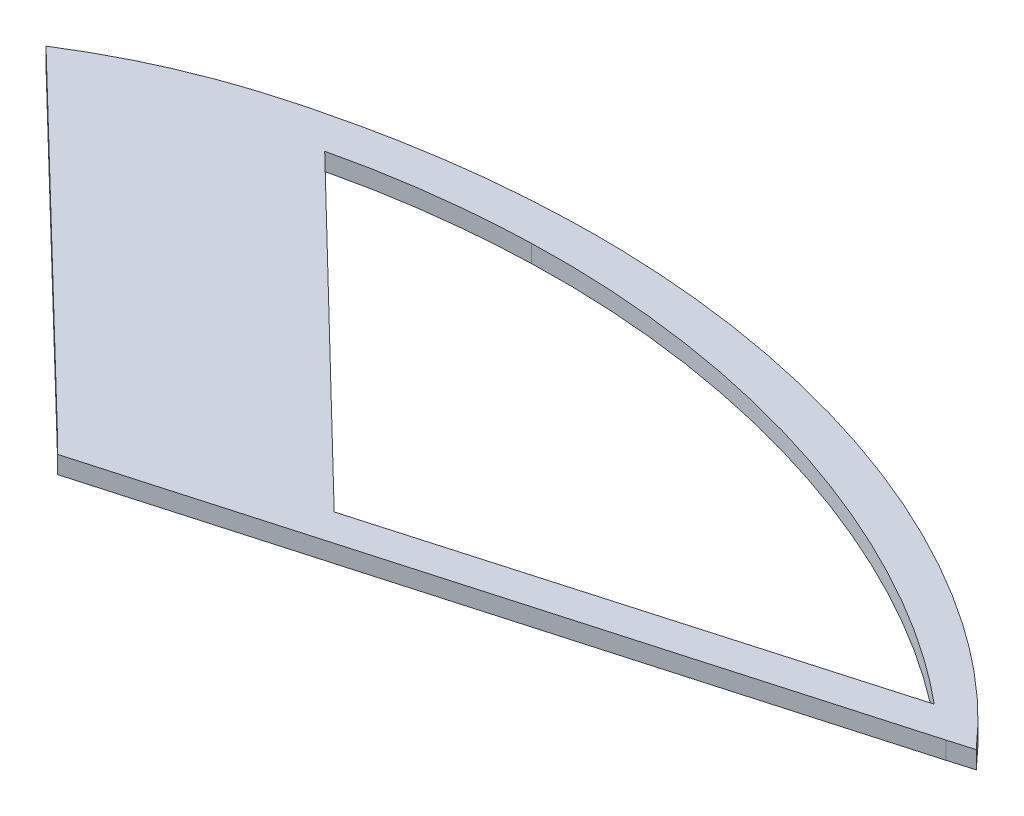
ISO-10303-21;
HEADER;
FILE_DESCRIPTION(('STEP AP214'),'2;1');
FILE_NAME('part.step','',(''),(''),'','','');
FILE_SCHEMA(('AUTOMOTIVE_DESIGN { 1 0 10303 214 1 1 1 1 }'));
ENDSEC;
DATA;
#1=APPLICATION_CONTEXT('core data for automotive mechanical design processes');
#2=APPLICATION_PROTOCOL_DEFINITION('international standard','automotive_design',2000,#1);
#3=PRODUCT_CONTEXT('',#1,'mechanical');
#4=PRODUCT('Part','Part','',(#3));
#5=PRODUCT_RELATED_PRODUCT_CATEGORY('part','',(#4));
#6=PRODUCT_DEFINITION_FORMATION('','',#4);
#7=PRODUCT_DEFINITION_CONTEXT('part definition',#1,'design');
#8=PRODUCT_DEFINITION('design','',#6,#7);
#9=PRODUCT_DEFINITION_SHAPE('','',#8);
#10=(LENGTH_UNIT() NAMED_UNIT(*) SI_UNIT(.MILLI.,.METRE.));
#11=(NAMED_UNIT(*) PLANE_ANGLE_UNIT() SI_UNIT($,.RADIAN.));
#12=(NAMED_UNIT(*) SI_UNIT($,.STERADIAN.) SOLID_ANGLE_UNIT());
#13=UNCERTAINTY_MEASURE_WITH_UNIT(LENGTH_MEASURE(1.E-05),#10,'distance_accuracy_value','');
#14=(GEOMETRIC_REPRESENTATION_CONTEXT(3) GLOBAL_UNCERTAINTY_ASSIGNED_CONTEXT((#13)) GLOBAL_UNIT_ASSIGNED_CONTEXT((#10,
#11,#12)) REPRESENTATION_CONTEXT('',''));
#15=CARTESIAN_POINT('',(0.,0.,0.));
#16=DIRECTION('',(0.,0.,1.));
#17=DIRECTION('',(1.,0.,0.));
#18=AXIS2_PLACEMENT_3D('',#15,#16,#17);
#19=CARTESIAN_POINT('',(-9.871927348,12.954,-83.317512981));
#20=DIRECTION('',(0.,1.,0.));
#21=DIRECTION('',(0.,0.,1.));
#22=AXIS2_PLACEMENT_3D('',#19,#20,#21);
#23=PLANE('',#22);
#24=CARTESIAN_POINT('',(-6.44549620304291,12.954,-82.3392040324643));
#25=CARTESIAN_POINT('',(-6.34659800777921,12.954,-82.3626682368923));
#26=CARTESIAN_POINT('',(-6.24741169684658,12.954,-82.3849041496113));
#27=CARTESIAN_POINT('',(-6.04852286511272,12.954,-82.4269296454256));
#28=CARTESIAN_POINT('',(-5.94882034827822,12.954,-82.4467192472902));
#29=CARTESIAN_POINT('',(-5.68039666446252,12.954,-82.4966044420451));
#30=CARTESIAN_POINT('',(-5.51125375014717,12.954,-82.5244556849329));
#31=CARTESIAN_POINT('',(-5.17197242544379,12.954,-82.5733828893412));
#32=CARTESIAN_POINT('',(-5.00183387155782,12.954,-82.5944578484471));
#33=CARTESIAN_POINT('',(-4.65984033571563,12.954,-82.6301726004586));
#34=CARTESIAN_POINT('',(-4.48798120929984,12.954,-82.6447724503704));
#35=CARTESIAN_POINT('',(-4.1438846534634,12.954,-82.6676645563772));
#36=CARTESIAN_POINT('',(-3.97164732981602,12.954,-82.6759583946487));
#37=CARTESIAN_POINT('',(-3.7993321421016,12.954,-82.6812606729969));
#38=B_SPLINE_CURVE_WITH_KNOTS('',3,(#24,#25,#26,#27,#28,#29,#30,#31,#32,#33,#34,#35,#36,#37),
.UNSPECIFIED.,.F.,.F.,(4,2,2,2,2,2,4),(0.,0.304916879839936,0.609831420046243,1.12394181147945,
1.63812822024012,2.15544381137501,2.67262956529792),.UNSPECIFIED.);
#39=CARTESIAN_POINT('',(-6.44549620402146,12.954,-82.3392040322321));
#40=VERTEX_POINT('',#39);
#41=CARTESIAN_POINT('',(-3.79933214210171,12.954,-82.6812606729969));
#42=VERTEX_POINT('',#41);
#43=EDGE_CURVE('E87',#40,#42,#38,.T.);
#44=ORIENTED_EDGE('',*,*,#43,.T.);
#45=CARTESIAN_POINT('',(-3.79933214210182,12.954,-82.6812606729968));
#46=CARTESIAN_POINT('',(-3.59617572272677,12.954,-82.6876119718258));
#47=CARTESIAN_POINT('',(-3.39284743166303,12.954,-82.6890689719829));
#48=CARTESIAN_POINT('',(-2.78115641969021,12.954,-82.6790622284626));
#49=CARTESIAN_POINT('',(-2.37296203900884,12.954,-82.65307475667));
#50=CARTESIAN_POINT('',(-1.56039169667328,12.954,-82.5642687335934));
#51=CARTESIAN_POINT('',(-1.15601895811979,12.954,-82.5014214997044));
#52=CARTESIAN_POINT('',(-0.376428822526477,12.954,-82.3448357418596));
#53=CARTESIAN_POINT('',(-0.000832718618430368,12.954,-82.2529903114214));
#54=CARTESIAN_POINT('',(0.555712122099293,12.954,-82.092278675641));
#55=CARTESIAN_POINT('',(0.740050038313632,12.954,-82.0348977158226));
#56=CARTESIAN_POINT('',(1.10623976627383,12.954,-81.91251159206));
#57=CARTESIAN_POINT('',(1.28809095956808,12.954,-81.8475045686687));
#58=CARTESIAN_POINT('',(1.67353557019621,12.954,-81.7005072194933));
#59=CARTESIAN_POINT('',(1.87670772228265,12.954,-81.6174099214902));
#60=CARTESIAN_POINT('',(2.27877675627463,12.954,-81.4413634426536));
#61=CARTESIAN_POINT('',(2.47767302030433,12.954,-81.3484128493534));
#62=CARTESIAN_POINT('',(2.87046158022985,12.954,-81.1525709207472));
#63=CARTESIAN_POINT('',(3.06435504557182,12.954,-81.0496819357944));
#64=CARTESIAN_POINT('',(3.44733541386283,12.954,-80.8332074195657));
#65=CARTESIAN_POINT('',(3.63639421674016,12.954,-80.7195721009166));
#66=CARTESIAN_POINT('',(4.00779689766742,12.954,-80.4816757996074));
#67=CARTESIAN_POINT('',(4.1901394727901,12.954,-80.3574127705757));
#68=CARTESIAN_POINT('',(4.4577304457105,12.954,-80.1626783989408));
#69=CARTESIAN_POINT('',(4.5459970764099,12.954,-80.0963300142813));
#70=CARTESIAN_POINT('',(4.72033458161968,12.954,-79.9607900047128));
#71=CARTESIAN_POINT('',(4.80640520461762,12.954,-79.891598056474));
#72=CARTESIAN_POINT('',(4.89127951213176,12.954,-79.8209494748903));
#73=B_SPLINE_CURVE_WITH_KNOTS('',3,(#45,#46,#47,#48,#49,#50,#51,#52,#53,#54,#55,#56,#57,#58,#59,
#60,#61,#62,#63,#64,#65,#66,#67,#68,#69,#70,#71,#72),.UNSPECIFIED.,.F.,.F.,(4,2,2,2,2,2,2,2,2,2,
2,2,2,4),(0.,0.609774049446489,1.83493903388301,3.06105865376051,4.21961329184825,
4.79866354834578,5.37785528807172,6.03612292805049,6.69448505841803,7.35269187064562,
8.01411334448607,8.67566246336649,9.00687834191437,9.33813198641507),.UNSPECIFIED.);
#74=CARTESIAN_POINT('',(4.891279512,12.954,-79.820949475));
#75=VERTEX_POINT('',#74);
#76=EDGE_CURVE('E90',#42,#75,#73,.T.);
#77=ORIENTED_EDGE('',*,*,#76,.T.);
#78=DIRECTION('',(-0.96139006085871,0.,0.275189300086477));
#79=VECTOR('',#78,1.);
#80=CARTESIAN_POINT('',(1.516581107,12.954,-78.8549722615));
#81=LINE('',#80,#79);
#82=CARTESIAN_POINT('',(-1.858117298,12.954,-77.888995048));
#83=VERTEX_POINT('',#82);
#84=EDGE_CURVE('E113',#75,#83,#81,.T.);
#85=ORIENTED_EDGE('',*,*,#84,.T.);
#86=DIRECTION('',(-0.717756378085368,0.,-0.696294321187366));
#87=VECTOR('',#86,1.);
#88=CARTESIAN_POINT('',(-4.1518067515,12.954,-80.11409954));
#89=LINE('',#88,#87);
#90=EDGE_CURVE('E92',#83,#40,#89,.T.);
#91=ORIENTED_EDGE('',*,*,#90,.T.);
#92=EDGE_LOOP('',(#44,#77,#85,#91));
#93=FACE_BOUND('',#92,.T.);
#94=DIRECTION('',(0.96061640835191,0.,-0.277877879661329));
#95=VECTOR('',#94,1.);
#96=CARTESIAN_POINT('',(5.596084036,12.954,-79.5065293905));
#97=LINE('',#96,#95);
#98=CARTESIAN_POINT('',(5.428352324718,12.954,-79.4570364438506));
#99=VERTEX_POINT('',#98);
#100=CARTESIAN_POINT('',(5.76465255782301,12.954,-79.5552912722026));
#101=VERTEX_POINT('',#100);
#102=EDGE_CURVE('E120',#99,#101,#97,.T.);
#103=ORIENTED_EDGE('',*,*,#102,.T.);
#104=CARTESIAN_POINT('',(5.76465255764603,12.954,-79.5552912724051));
#105=CARTESIAN_POINT('',(5.69771351624012,12.954,-79.6319005370332));
#106=CARTESIAN_POINT('',(5.62928088525685,12.954,-79.70716270109));
#107=CARTESIAN_POINT('',(5.48964442494502,12.954,-79.8550308917549));
#108=CARTESIAN_POINT('',(5.41844140963843,12.954,-79.9276376866061));
#109=CARTESIAN_POINT('',(5.05352737794468,12.954,-80.2866114680925));
#110=CARTESIAN_POINT('',(4.7400108784828,12.954,-80.5533335244824));
#111=CARTESIAN_POINT('',(4.24718059823801,12.954,-80.9231372974576));
#112=CARTESIAN_POINT('',(4.07884859171253,12.954,-81.0415285886536));
#113=CARTESIAN_POINT('',(3.73565984346875,12.954,-81.2684541980265));
#114=CARTESIAN_POINT('',(3.56080417347671,12.954,-81.3769901252986));
#115=CARTESIAN_POINT('',(3.08132272495971,12.954,-81.6569556093497));
#116=CARTESIAN_POINT('',(2.77138981465536,12.954,-81.8193422154085));
#117=CARTESIAN_POINT('',(2.13886102993561,12.954,-82.1174285859288));
#118=CARTESIAN_POINT('',(1.81625854804351,12.954,-82.2531141974055));
#119=CARTESIAN_POINT('',(1.16091297685525,12.954,-82.498523397323));
#120=CARTESIAN_POINT('',(0.828158725032067,12.954,-82.6082171526901));
#121=CARTESIAN_POINT('',(0.155401539185784,12.954,-82.8017631038007));
#122=CARTESIAN_POINT('',(-0.18459947660993,12.954,-82.8856220494112));
#123=CARTESIAN_POINT('',(-1.07063785206153,12.954,-83.0692553577102));
#124=CARTESIAN_POINT('',(-1.62086551224779,12.954,-83.1496484220788));
#125=CARTESIAN_POINT('',(-2.44872275258357,12.954,-83.2213780353821));
#126=CARTESIAN_POINT('',(-2.72449456971258,12.954,-83.2371628438439));
#127=CARTESIAN_POINT('',(-3.27651475623878,12.954,-83.2525295850057));
#128=CARTESIAN_POINT('',(-3.55276316833494,12.954,-83.2521099815244));
#129=CARTESIAN_POINT('',(-3.82884971681048,12.954,-83.2435415970991));
#130=B_SPLINE_CURVE_WITH_KNOTS('',3,(#104,#105,#106,#107,#108,#109,#110,#111,#112,#113,#114,
#115,#116,#117,#118,#119,#120,#121,#122,#123,#124,#125,#126,#127,#128,#129),.UNSPECIFIED.,.F.,
.F.,(4,2,2,2,2,2,2,2,2,2,2,2,4),(0.,0.305123056008634,0.610157124927938,1.84044459812942,
2.45762505185383,3.07470455603745,4.12294777812222,5.17174513851436,6.22174052438363,
7.2714613445922,8.93518186638625,9.76346250796041,10.5918216708866),.UNSPECIFIED.);
#131=CARTESIAN_POINT('',(-3.82884978506695,12.9540000000339,-83.243543794024));
#132=VERTEX_POINT('',#131);
#133=EDGE_CURVE('E125',#101,#132,#130,.T.);
#134=ORIENTED_EDGE('',*,*,#133,.T.);
#135=CARTESIAN_POINT('',(-3.82884985199436,12.954,-83.243545988987));
#136=CARTESIAN_POINT('',(-4.6137098160745,12.954,-83.2197899996327));
#137=CARTESIAN_POINT('',(-5.39196475979922,12.954,-83.1113782879362));
#138=CARTESIAN_POINT('',(-6.16967656058968,12.954,-83.0030422366073));
#139=CARTESIAN_POINT('',(-6.93166914869493,12.954,-82.811200155791));
#140=B_SPLINE_CURVE_WITH_KNOTS('',2,(#135,#136,#137,#138,#139),.UNSPECIFIED.,.F.,.F.,(3,2,3),
(0.,0.5,1.),.UNSPECIFIED.);
#141=CARTESIAN_POINT('',(-6.93166863400027,12.954,-82.8111980199354));
#142=VERTEX_POINT('',#141);
#143=EDGE_CURVE('E159',#132,#142,#140,.T.);
#144=ORIENTED_EDGE('',*,*,#143,.T.);
#145=DIRECTION('',(-0.974207269038904,0.,0.225655039721608));
#146=VECTOR('',#145,1.);
#147=CARTESIAN_POINT('',(-7.0222465505,12.954,-82.790215258));
#148=LINE('',#147,#146);
#149=CARTESIAN_POINT('',(-7.1128249802251,12.9540000000508,-82.7692346311027));
#150=VERTEX_POINT('',#149);
#151=EDGE_CURVE('E153',#142,#150,#148,.T.);
#152=ORIENTED_EDGE('',*,*,#151,.T.);
#153=CARTESIAN_POINT('',(-9.778667429,12.9540000001016,-81.64062135));
#154=CARTESIAN_POINT('',(-8.941178496,12.9540000001016,-82.16557122));
#155=CARTESIAN_POINT('',(-8.139573679,12.9540000001016,-82.50039316));
#156=CARTESIAN_POINT('',(-7.112824981,12.9540000001016,-82.769234631));
#157=B_SPLINE_CURVE_WITH_KNOTS('',3,(#153,#154,#155,#156),.UNSPECIFIED.,.F.,.F.,(4,4),(6.,7.),.UNSPECIFIED.);
#158=CARTESIAN_POINT('',(-9.77866742780706,12.9540000000254,-81.6406213507779));
#159=VERTEX_POINT('',#158);
#160=EDGE_CURVE('E147',#150,#159,#157,.F.);
#161=ORIENTED_EDGE('',*,*,#160,.T.);
#162=DIRECTION('',(0.719034699110786,0.,0.694974173242907));
#163=VECTOR('',#162,1.);
#164=CARTESIAN_POINT('',(-7.309608835,12.954,-79.254183036));
#165=LINE('',#164,#163);
#166=CARTESIAN_POINT('',(-4.840550241,12.954,-76.867744722));
#167=VERTEX_POINT('',#166);
#168=EDGE_CURVE('E141',#159,#167,#165,.T.);
#169=ORIENTED_EDGE('',*,*,#168,.T.);
#170=DIRECTION('',(0.709861967944082,0.,0.704340816981776));
#171=VECTOR('',#170,1.);
#172=CARTESIAN_POINT('',(-4.7103256315,12.954,-76.738532971));
#173=LINE('',#172,#171);
#174=CARTESIAN_POINT('',(-4.58010102462412,12.954,-76.6093212292258));
#175=VERTEX_POINT('',#174);
#176=EDGE_CURVE('E135',#167,#175,#173,.T.);
#177=ORIENTED_EDGE('',*,*,#176,.T.);
#178=DIRECTION('',(0.961848584758287,0.,-0.273582345918885));
#179=VECTOR('',#178,1.);
#180=CARTESIAN_POINT('',(0.47462217432,12.954,-78.047055891245));
#181=LINE('',#180,#179);
#182=EDGE_CURVE('E134',#175,#99,#181,.T.);
#183=ORIENTED_EDGE('',*,*,#182,.T.);
#184=EDGE_LOOP('',(#103,#134,#144,#152,#161,#169,#177,#183));
#185=FACE_BOUND('',#184,.T.);
#186=ADVANCED_FACE('F17',(#93,#185),#23,.T.);
#187=CARTESIAN_POINT('',(-3.38996971,12.954,-68.743646728));
#188=DIRECTION('',(0.,-1.,0.));
#189=DIRECTION('',(0.,0.,-1.));
#190=AXIS2_PLACEMENT_3D('',#187,#188,#189);
#191=CYLINDRICAL_SURFACE('',#190,14.50653971);
#192=CARTESIAN_POINT('',(-3.38996971,12.7,-68.743646728));
#193=DIRECTION('',(0.,-1.,0.));
#194=DIRECTION('',(0.,0.,-1.));
#195=AXIS2_PLACEMENT_3D('',#192,#193,#194);
#196=CIRCLE('',#195,14.50653971);
#197=CARTESIAN_POINT('',(-3.82884978599718,12.7,-83.2435437929935));
#198=VERTEX_POINT('',#197);
#199=CARTESIAN_POINT('',(-6.93166865622819,12.7,-82.8111980148867));
#200=VERTEX_POINT('',#199);
#201=EDGE_CURVE('E101',#198,#200,#196,.F.);
#202=ORIENTED_EDGE('',*,*,#201,.T.);
#203=DIRECTION('',(0.,1.,0.));
#204=VECTOR('',#203,1.);
#205=CARTESIAN_POINT('',(-6.93166812,12.827,-82.811195885));
#206=LINE('',#205,#204);
#207=EDGE_CURVE('E156',#200,#142,#206,.T.);
#208=ORIENTED_EDGE('',*,*,#207,.T.);
#209=ORIENTED_EDGE('',*,*,#143,.F.);
#210=DIRECTION('',(0.,-1.,0.));
#211=VECTOR('',#210,1.);
#212=CARTESIAN_POINT('',(-3.82884972,12.827,-83.243541597));
#213=LINE('',#212,#211);
#214=EDGE_CURVE('E116',#132,#198,#213,.T.);
#215=ORIENTED_EDGE('',*,*,#214,.T.);
#216=EDGE_LOOP('',(#202,#208,#209,#215));
#217=FACE_BOUND('',#216,.T.);
#218=ADVANCED_FACE('F238',(#217),#191,.T.);
#219=CARTESIAN_POINT('',(-7.112824981,12.7,-82.769234631));
#220=DIRECTION('',(0.225655039721608,0.,0.974207269038904));
#221=DIRECTION('',(0.974207269038904,0.,-0.225655039721608));
#222=AXIS2_PLACEMENT_3D('',#219,#220,#221);
#223=PLANE('',#222);
#224=ORIENTED_EDGE('',*,*,#207,.F.);
#225=DIRECTION('',(0.974207269038904,0.,-0.225655039721608));
#226=VECTOR('',#225,1.);
#227=CARTESIAN_POINT('',(-7.112824981,12.7,-82.769234631));
#228=LINE('',#227,#226);
#229=CARTESIAN_POINT('',(-7.11282498036341,12.7,-82.7692346311667));
#230=VERTEX_POINT('',#229);
#231=EDGE_CURVE('E220',#200,#230,#228,.F.);
#232=ORIENTED_EDGE('',*,*,#231,.T.);
#233=DIRECTION('',(0.,1.,0.));
#234=VECTOR('',#233,1.);
#235=CARTESIAN_POINT('',(-7.112824981,12.827,-82.769234631));
#236=LINE('',#235,#234);
#237=EDGE_CURVE('E150',#230,#150,#236,.T.);
#238=ORIENTED_EDGE('',*,*,#237,.T.);
#239=ORIENTED_EDGE('',*,*,#151,.F.);
#240=EDGE_LOOP('',(#224,#232,#238,#239));
#241=FACE_BOUND('',#240,.T.);
#242=ADVANCED_FACE('F203',(#241),#223,.F.);
#243=CARTESIAN_POINT('',(-7.112824981,12.9794,-82.769234631));
#244=CARTESIAN_POINT('',(-7.112824981,12.6746,-82.769234631));
#245=CARTESIAN_POINT('',(-8.139573679,12.9794,-82.50039316));
#246=CARTESIAN_POINT('',(-8.139573679,12.6746,-82.50039316));
#247=CARTESIAN_POINT('',(-8.941178496,12.9794,-82.16557122));
#248=CARTESIAN_POINT('',(-8.941178496,12.6746,-82.16557122));
#249=CARTESIAN_POINT('',(-9.778667429,12.9794,-81.64062135));
#250=CARTESIAN_POINT('',(-9.778667429,12.6746,-81.64062135));
#251=B_SPLINE_SURFACE_WITH_KNOTS('',3,1,((#243,#244),(#245,#246),(#247,#248),(#249,#250)),
.UNSPECIFIED.,.F.,.F.,.F.,(4,4),(2,2),(6.,7.),(0.,1.),.UNSPECIFIED.);
#252=CARTESIAN_POINT('',(-7.11282497972682,12.7,-82.7692346313334));
#253=CARTESIAN_POINT('',(-7.21111539739219,12.7,-82.7434969137732));
#254=CARTESIAN_POINT('',(-7.30912870562555,12.7,-82.7166896821853));
#255=CARTESIAN_POINT('',(-7.50451533652807,12.7,-82.6605988433057));
#256=CARTESIAN_POINT('',(-7.60188817460104,12.7,-82.6313135515954));
#257=CARTESIAN_POINT('',(-7.87983883992774,12.7,-82.5433631412691));
#258=CARTESIAN_POINT('',(-8.05934644340936,12.7,-82.4812428574809));
#259=CARTESIAN_POINT('',(-8.41402752469317,12.7,-82.3457075393112));
#260=CARTESIAN_POINT('',(-8.58920228793245,12.7,-82.2722959025791));
#261=CARTESIAN_POINT('',(-8.84930369127706,12.7,-82.152735238925));
#262=CARTESIAN_POINT('',(-8.93624927751587,12.7,-82.1109321636776));
#263=CARTESIAN_POINT('',(-9.1086739069071,12.7,-82.0243858760158));
#264=CARTESIAN_POINT('',(-9.19415286798293,12.7,-81.9796424997261));
#265=CARTESIAN_POINT('',(-9.36368250399626,12.7,-81.8873231384286));
#266=CARTESIAN_POINT('',(-9.44773153995531,12.7,-81.8397441519452));
#267=CARTESIAN_POINT('',(-9.61432133762009,12.7,-81.7420372039891));
#268=CARTESIAN_POINT('',(-9.69686229376708,12.7,-81.6919095743185));
#269=CARTESIAN_POINT('',(-9.77866742661721,12.7,-81.6406213514936));
#270=B_SPLINE_CURVE_WITH_KNOTS('',3,(#252,#253,#254,#255,#256,#257,#258,#259,#260,#261,#262,
#263,#264,#265,#266,#267,#268,#269),.UNSPECIFIED.,.F.,.F.,(4,2,2,2,2,2,2,2,4),(0.,
0.304807882431094,0.609824643207969,1.1793438443341,1.74869200709822,2.03806219358622,
2.32744852159089,2.61714679948856,2.90680745830835),.UNSPECIFIED.);
#271=CARTESIAN_POINT('',(-9.77866742851036,12.7,-81.6406213495268));
#272=VERTEX_POINT('',#271);
#273=EDGE_CURVE('E212',#230,#272,#270,.T.);
#274=DIRECTION('',(0.,1.,0.));
#275=VECTOR('',#274,1.);
#276=CARTESIAN_POINT('',(-9.778667429,12.827,-81.64062135));
#277=LINE('',#276,#275);
#278=EDGE_CURVE('E144',#272,#159,#277,.T.);
#279=ORIENTED_EDGE('',*,*,#237,.F.);
#280=ORIENTED_EDGE('',*,*,#273,.T.);
#281=ORIENTED_EDGE('',*,*,#278,.T.);
#282=ORIENTED_EDGE('',*,*,#160,.F.);
#283=EDGE_LOOP('',(#279,#280,#281,#282));
#284=FACE_BOUND('',#283,.T.);
#285=ADVANCED_FACE('F190',(#284),#251,.F.);
#286=CARTESIAN_POINT('',(-4.840550241,12.7,-76.867744722));
#287=DIRECTION('',(0.694974173242907,0.,-0.719034699110786));
#288=DIRECTION('',(-0.719034699110786,0.,-0.694974173242907));
#289=AXIS2_PLACEMENT_3D('',#286,#287,#288);
#290=PLANE('',#289);
#291=ORIENTED_EDGE('',*,*,#278,.F.);
#292=DIRECTION('',(-0.719034699110786,0.,-0.694974173242907));
#293=VECTOR('',#292,1.);
#294=CARTESIAN_POINT('',(-4.840550241,12.7,-76.867744722));
#295=LINE('',#294,#293);
#296=CARTESIAN_POINT('',(-4.84055024100028,12.7,-76.8677447220003));
#297=VERTEX_POINT('',#296);
#298=EDGE_CURVE('E219',#272,#297,#295,.F.);
#299=ORIENTED_EDGE('',*,*,#298,.T.);
#300=DIRECTION('',(0.,1.,0.));
#301=VECTOR('',#300,1.);
#302=CARTESIAN_POINT('',(-4.840550241,12.827,-76.867744722));
#303=LINE('',#302,#301);
#304=EDGE_CURVE('E138',#297,#167,#303,.T.);
#305=ORIENTED_EDGE('',*,*,#304,.T.);
#306=ORIENTED_EDGE('',*,*,#168,.F.);
#307=EDGE_LOOP('',(#291,#299,#305,#306));
#308=FACE_BOUND('',#307,.T.);
#309=ADVANCED_FACE('F202',(#308),#290,.F.);
#310=CARTESIAN_POINT('',(-4.580101022,12.7,-76.60932122));
#311=DIRECTION('',(0.704340816981776,0.,-0.709861967944082));
#312=DIRECTION('',(-0.709861967944082,0.,-0.704340816981776));
#313=AXIS2_PLACEMENT_3D('',#310,#311,#312);
#314=PLANE('',#313);
#315=ORIENTED_EDGE('',*,*,#304,.F.);
#316=DIRECTION('',(-0.709861967944082,0.,-0.704340816981776));
#317=VECTOR('',#316,1.);
#318=CARTESIAN_POINT('',(-4.580101022,12.7,-76.60932122));
#319=LINE('',#318,#317);
#320=CARTESIAN_POINT('',(-4.580101022,12.7,-76.60932122));
#321=VERTEX_POINT('',#320);
#322=EDGE_CURVE('E347',#297,#321,#319,.F.);
#323=ORIENTED_EDGE('',*,*,#322,.T.);
#324=DIRECTION('',(0.,1.,0.));
#325=VECTOR('',#324,1.);
#326=CARTESIAN_POINT('',(-4.580101022,12.827,-76.60932122));
#327=LINE('',#326,#325);
#328=EDGE_CURVE('E131',#321,#175,#327,.T.);
#329=ORIENTED_EDGE('',*,*,#328,.T.);
#330=ORIENTED_EDGE('',*,*,#176,.F.);
#331=EDGE_LOOP('',(#315,#323,#329,#330));
#332=FACE_BOUND('',#331,.T.);
#333=ADVANCED_FACE('F280',(#332),#314,.F.);
#334=CARTESIAN_POINT('',(5.529345371,12.7,-79.484790562));
#335=DIRECTION('',(-0.273582351133371,0.,-0.96184858327511));
#336=DIRECTION('',(-0.96184858327511,0.,0.273582351133371));
#337=AXIS2_PLACEMENT_3D('',#334,#335,#336);
#338=PLANE('',#337);
#339=ORIENTED_EDGE('',*,*,#328,.F.);
#340=DIRECTION('',(-0.96184858327511,0.,0.273582351133371));
#341=VECTOR('',#340,1.);
#342=CARTESIAN_POINT('',(5.529345371,12.7,-79.484790562));
#343=LINE('',#342,#341);
#344=CARTESIAN_POINT('',(5.42807727553156,12.7,-79.4569568881225));
#345=VERTEX_POINT('',#344);
#346=EDGE_CURVE('E342',#321,#345,#343,.F.);
#347=ORIENTED_EDGE('',*,*,#346,.T.);
#348=CARTESIAN_POINT('',(5.42802622835436,12.7,-79.4559719623349));
#349=DIRECTION('',(0.,1.,0.));
#350=VECTOR('',#349,1.);
#351=LINE('',#348,#350);
#352=EDGE_CURVE('E128',#345,#99,#351,.T.);
#353=ORIENTED_EDGE('',*,*,#352,.T.);
#354=ORIENTED_EDGE('',*,*,#182,.F.);
#355=EDGE_LOOP('',(#339,#347,#353,#354));
#356=FACE_BOUND('',#355,.T.);
#357=ADVANCED_FACE('F270',(#356),#338,.F.);
#358=CARTESIAN_POINT('',(5.764652558,12.7,-79.555291272));
#359=DIRECTION('',(-0.277877879661329,0.,-0.96061640835191));
#360=DIRECTION('',(-0.96061640835191,0.,0.277877879661329));
#361=AXIS2_PLACEMENT_3D('',#358,#359,#360);
#362=PLANE('',#361);
#363=ORIENTED_EDGE('',*,*,#352,.F.);
#364=DIRECTION('',(-0.96061640835191,0.,0.277877879661329));
#365=VECTOR('',#364,1.);
#366=CARTESIAN_POINT('',(5.764652558,12.7,-79.555291272));
#367=LINE('',#366,#365);
#368=CARTESIAN_POINT('',(5.76465255783353,12.7,-79.5552912721905));
#369=VERTEX_POINT('',#368);
#370=EDGE_CURVE('E340',#345,#369,#367,.F.);
#371=ORIENTED_EDGE('',*,*,#370,.T.);
#372=DIRECTION('',(0.,1.,0.));
#373=VECTOR('',#372,1.);
#374=CARTESIAN_POINT('',(5.764652558,12.827,-79.555291272));
#375=LINE('',#374,#373);
#376=EDGE_CURVE('E119',#369,#101,#375,.T.);
#377=ORIENTED_EDGE('',*,*,#376,.T.);
#378=ORIENTED_EDGE('',*,*,#102,.F.);
#379=EDGE_LOOP('',(#363,#371,#377,#378));
#380=FACE_BOUND('',#379,.T.);
#381=ADVANCED_FACE('F279',(#380),#362,.F.);
#382=CARTESIAN_POINT('',(5.764652558,12.9794,-79.555291272));
#383=CARTESIAN_POINT('',(5.764652558,12.6746,-79.555291272));
#384=CARTESIAN_POINT('',(3.795945853,12.9794,-81.808466402));
#385=CARTESIAN_POINT('',(3.795945853,12.6746,-81.808466402));
#386=CARTESIAN_POINT('',(0.1204286,12.9794,-83.366242118));
#387=CARTESIAN_POINT('',(0.1204286,12.6746,-83.366242118));
#388=CARTESIAN_POINT('',(-3.82884972,12.9794,-83.243541597));
#389=CARTESIAN_POINT('',(-3.82884972,12.6746,-83.243541597));
#390=B_SPLINE_SURFACE_WITH_KNOTS('',3,1,((#382,#383),(#384,#385),(#386,#387),(#388,#389)),
.UNSPECIFIED.,.F.,.F.,.F.,(4,4),(2,2),(3.,4.),(0.,1.),.UNSPECIFIED.);
#391=CARTESIAN_POINT('',(5.76465255766707,12.7,-79.555291272381));
#392=CARTESIAN_POINT('',(5.69771351626147,12.7,-79.6319005370094));
#393=CARTESIAN_POINT('',(5.6292808852785,12.7,-79.7071627010665));
#394=CARTESIAN_POINT('',(5.48964442496725,12.7,-79.8550308917319));
#395=CARTESIAN_POINT('',(5.41844140966094,12.7,-79.9276376865835));
#396=CARTESIAN_POINT('',(5.05352737796854,12.7,-80.2866114680712));
#397=CARTESIAN_POINT('',(4.74001087850753,12.7,-80.5533335244622));
#398=CARTESIAN_POINT('',(4.24718059826385,12.7,-80.923137297439));
#399=CARTESIAN_POINT('',(4.07884859173871,12.7,-81.0415285886355));
#400=CARTESIAN_POINT('',(3.73565984349557,12.7,-81.2684541980095));
#401=CARTESIAN_POINT('',(3.56080417350384,12.7,-81.3769901252821));
#402=CARTESIAN_POINT('',(3.08132272498825,12.7,-81.6569556093342));
#403=CARTESIAN_POINT('',(2.77138981468499,12.7,-81.8193422153935));
#404=CARTESIAN_POINT('',(2.13886102996739,12.7,-82.1174285859149));
#405=CARTESIAN_POINT('',(1.81625854807635,12.7,-82.2531141973922));
#406=CARTESIAN_POINT('',(1.16091297689014,12.7,-82.498523397311));
#407=CARTESIAN_POINT('',(0.828158725067938,12.7,-82.6082171526787));
#408=CARTESIAN_POINT('',(0.155401539223578,12.7,-82.8017631037908));
#409=CARTESIAN_POINT('',(-0.184599476571195,12.7,-82.8856220494021));
#410=CARTESIAN_POINT('',(-1.07063785203859,12.7,-83.0692553577071));
#411=CARTESIAN_POINT('',(-1.62086551224211,12.7,-83.1496484220788));
#412=CARTESIAN_POINT('',(-2.4487227526039,12.7,-83.2213780353836));
#413=CARTESIAN_POINT('',(-2.72449456974157,12.7,-83.2371628438455));
#414=CARTESIAN_POINT('',(-3.27651475628508,12.7,-83.2525295850063));
#415=CARTESIAN_POINT('',(-3.55276316838989,12.7,-83.252109981524));
#416=CARTESIAN_POINT('',(-3.82884971687403,12.7,-83.2435415970971));
#417=B_SPLINE_CURVE_WITH_KNOTS('',3,(#391,#392,#393,#394,#395,#396,#397,#398,#399,#400,#401,
#402,#403,#404,#405,#406,#407,#408,#409,#410,#411,#412,#413,#414,#415,#416),.UNSPECIFIED.,.F.,
.F.,(4,2,2,2,2,2,2,2,2,2,2,2,4),(0.,0.305123056008647,0.610157124927955,1.84044459812954,
2.45762505185399,3.07470455603768,4.12294777812024,5.17174513851016,6.22174052437726,
7.27146134458368,8.93518186642985,9.76346250802993,10.591821670982),.UNSPECIFIED.);
#418=EDGE_CURVE('E345',#369,#198,#417,.T.);
#419=ORIENTED_EDGE('',*,*,#376,.F.);
#420=ORIENTED_EDGE('',*,*,#418,.T.);
#421=ORIENTED_EDGE('',*,*,#214,.F.);
#422=ORIENTED_EDGE('',*,*,#133,.F.);
#423=EDGE_LOOP('',(#419,#420,#421,#422));
#424=FACE_BOUND('',#423,.T.);
#425=ADVANCED_FACE('F283',(#424),#390,.F.);
#426=CARTESIAN_POINT('',(-1.858117298,12.7,-77.888995048));
#427=DIRECTION('',(0.275189300086477,0.,0.96139006085871));
#428=DIRECTION('',(0.96139006085871,0.,-0.275189300086477));
#429=AXIS2_PLACEMENT_3D('',#426,#427,#428);
#430=PLANE('',#429);
#431=DIRECTION('',(0.,-1.,0.));
#432=VECTOR('',#431,1.);
#433=CARTESIAN_POINT('',(4.891279512,12.827,-79.820949475));
#434=LINE('',#433,#432);
#435=CARTESIAN_POINT('',(4.89127951275024,12.7,-79.8209494752148));
#436=VERTEX_POINT('',#435);
#437=EDGE_CURVE('E95',#75,#436,#434,.T.);
#438=ORIENTED_EDGE('',*,*,#437,.T.);
#439=DIRECTION('',(0.96139006085871,0.,-0.275189300086477));
#440=VECTOR('',#439,1.);
#441=CARTESIAN_POINT('',(-1.858117298,12.7,-77.888995048));
#442=LINE('',#441,#440);
#443=CARTESIAN_POINT('',(-1.858117298,12.7,-77.888995048));
#444=VERTEX_POINT('',#443);
#445=EDGE_CURVE('E357',#436,#444,#442,.F.);
#446=ORIENTED_EDGE('',*,*,#445,.T.);
#447=DIRECTION('',(0.,1.,0.));
#448=VECTOR('',#447,1.);
#449=CARTESIAN_POINT('',(-1.858117298,12.827,-77.888995048));
#450=LINE('',#449,#448);
#451=EDGE_CURVE('E110',#444,#83,#450,.T.);
#452=ORIENTED_EDGE('',*,*,#451,.T.);
#453=ORIENTED_EDGE('',*,*,#84,.F.);
#454=EDGE_LOOP('',(#438,#446,#452,#453));
#455=FACE_BOUND('',#454,.T.);
#456=ADVANCED_FACE('F319',(#455),#430,.F.);
#457=CARTESIAN_POINT('',(-6.445496205,12.7,-82.339204032));
#458=DIRECTION('',(-0.696294321187366,0.,0.717756378085368));
#459=DIRECTION('',(0.717756378085368,0.,0.696294321187366));
#460=AXIS2_PLACEMENT_3D('',#457,#458,#459);
#461=PLANE('',#460);
#462=ORIENTED_EDGE('',*,*,#451,.F.);
#463=DIRECTION('',(0.717756378085368,0.,0.696294321187366));
#464=VECTOR('',#463,1.);
#465=CARTESIAN_POINT('',(-6.445496205,12.7,-82.339204032));
#466=LINE('',#465,#464);
#467=CARTESIAN_POINT('',(-6.44549620324045,12.7,-82.3392040324174));
#468=VERTEX_POINT('',#467);
#469=EDGE_CURVE('E304',#444,#468,#466,.F.);
#470=ORIENTED_EDGE('',*,*,#469,.T.);
#471=DIRECTION('',(0.,1.,0.));
#472=VECTOR('',#471,1.);
#473=CARTESIAN_POINT('',(-6.445496205,12.827,-82.339204032));
#474=LINE('',#473,#472);
#475=EDGE_CURVE('E96',#468,#40,#474,.T.);
#476=ORIENTED_EDGE('',*,*,#475,.T.);
#477=ORIENTED_EDGE('',*,*,#90,.F.);
#478=EDGE_LOOP('',(#462,#470,#476,#477));
#479=FACE_BOUND('',#478,.T.);
#480=ADVANCED_FACE('F311',(#479),#461,.F.);
#481=CARTESIAN_POINT('',(-6.445496205,12.9794,-82.339204032));
#482=CARTESIAN_POINT('',(-6.445496205,12.6746,-82.339204032));
#483=CARTESIAN_POINT('',(-5.629421986,12.9794,-82.532804618));
#484=CARTESIAN_POINT('',(-5.629421986,12.6746,-82.532804618));
#485=CARTESIAN_POINT('',(-4.757206491,12.9794,-82.651743095));
#486=CARTESIAN_POINT('',(-4.757206491,12.6746,-82.651743095));
#487=CARTESIAN_POINT('',(-3.799332142,12.9794,-82.681260673));
#488=CARTESIAN_POINT('',(-3.799332142,12.6746,-82.681260673));
#489=B_SPLINE_SURFACE_WITH_KNOTS('',3,1,((#481,#482),(#483,#484),(#485,#486),(#487,#488)),
.UNSPECIFIED.,.F.,.F.,.F.,(4,4),(2,2),(3.,4.),(0.,1.),.UNSPECIFIED.);
#490=CARTESIAN_POINT('',(-6.44549620148091,12.7,-82.3392040328348));
#491=CARTESIAN_POINT('',(-6.34659800621415,12.7,-82.3626682372499));
#492=CARTESIAN_POINT('',(-6.24741169527862,12.7,-82.3849041499561));
#493=CARTESIAN_POINT('',(-6.04852286353932,12.7,-82.4269296457446));
#494=CARTESIAN_POINT('',(-5.94882034670228,12.7,-82.4467192475964));
#495=CARTESIAN_POINT('',(-5.68039666301155,12.7,-82.4966044422924));
#496=CARTESIAN_POINT('',(-5.51125374882507,12.7,-82.5244556851397));
#497=CARTESIAN_POINT('',(-5.17197242438168,12.7,-82.5733828894782));
#498=CARTESIAN_POINT('',(-5.00183387062687,12.7,-82.5944578485547));
#499=CARTESIAN_POINT('',(-4.65984033505106,12.7,-82.6301726005176));
#500=CARTESIAN_POINT('',(-4.4879812087705,12.7,-82.6447724504105));
#501=CARTESIAN_POINT('',(-4.14388465320529,12.7,-82.6676645563895));
#502=CARTESIAN_POINT('',(-3.9716473296939,12.7,-82.6759583946522));
#503=CARTESIAN_POINT('',(-3.79933214211556,12.7,-82.6812606729965));
#504=B_SPLINE_CURVE_WITH_KNOTS('',3,(#490,#491,#492,#493,#494,#495,#496,#497,#498,#499,#500,
#501,#502,#503),.UNSPECIFIED.,.F.,.F.,(4,2,2,2,2,2,4),(0.,0.304916879839949,0.609831420046226,
1.12394181107866,1.63812821943834,2.15544381016444,2.67262956367891),.UNSPECIFIED.);
#505=CARTESIAN_POINT('',(-3.79933214205799,12.7,-82.6812606729982));
#506=VERTEX_POINT('',#505);
#507=EDGE_CURVE('E33',#468,#506,#504,.T.);
#508=DIRECTION('',(0.,1.,0.));
#509=VECTOR('',#508,1.);
#510=CARTESIAN_POINT('',(-3.799332142,12.827,-82.681260673));
#511=LINE('',#510,#509);
#512=EDGE_CURVE('E41',#506,#42,#511,.T.);
#513=ORIENTED_EDGE('',*,*,#475,.F.);
#514=ORIENTED_EDGE('',*,*,#507,.T.);
#515=ORIENTED_EDGE('',*,*,#512,.T.);
#516=ORIENTED_EDGE('',*,*,#43,.F.);
#517=EDGE_LOOP('',(#513,#514,#515,#516));
#518=FACE_BOUND('',#517,.T.);
#519=ADVANCED_FACE('F104',(#518),#489,.F.);
#520=CARTESIAN_POINT('',(-3.799332142,12.9794,-82.681260673));
#521=CARTESIAN_POINT('',(-3.799332142,12.6746,-82.681260673));
#522=CARTESIAN_POINT('',(-0.438379668,12.9794,-82.786308525));
#523=CARTESIAN_POINT('',(-0.438379668,12.6746,-82.786308525));
#524=CARTESIAN_POINT('',(2.816946178,12.9794,-81.547727795));
#525=CARTESIAN_POINT('',(2.816946178,12.6746,-81.547727795));
#526=CARTESIAN_POINT('',(4.891279512,12.9794,-79.820949475));
#527=CARTESIAN_POINT('',(4.891279512,12.6746,-79.820949475));
#528=B_SPLINE_SURFACE_WITH_KNOTS('',3,1,((#520,#521),(#522,#523),(#524,#525),(#526,#527)),
.UNSPECIFIED.,.F.,.F.,.F.,(4,4),(2,2),(0.,1.),(0.,1.),.UNSPECIFIED.);
#529=CARTESIAN_POINT('',(-3.79933214211598,12.7,-82.6812606729964));
#530=CARTESIAN_POINT('',(-3.59617572274094,12.7,-82.6876119718255));
#531=CARTESIAN_POINT('',(-3.39284743167721,12.7,-82.6890689719829));
#532=CARTESIAN_POINT('',(-2.78115641970439,12.7,-82.6790622284632));
#533=CARTESIAN_POINT('',(-2.372962039023,12.7,-82.6530747566711));
#534=CARTESIAN_POINT('',(-1.56039169668733,12.7,-82.5642687335954));
#535=CARTESIAN_POINT('',(-1.15601895813377,12.7,-82.5014214997068));
#536=CARTESIAN_POINT('',(-0.376428822540251,12.7,-82.3448357418628));
#537=CARTESIAN_POINT('',(-0.000832718632073806,12.7,-82.252990311425));
#538=CARTESIAN_POINT('',(0.55571212208585,12.7,-82.092278675645));
#539=CARTESIAN_POINT('',(0.740050038300243,12.7,-82.0348977158269));
#540=CARTESIAN_POINT('',(1.10623976626059,12.7,-81.9125115920647));
#541=CARTESIAN_POINT('',(1.28809095955493,12.7,-81.8475045686735));
#542=CARTESIAN_POINT('',(1.67353557022938,12.7,-81.7005072194809));
#543=CARTESIAN_POINT('',(1.87670772236122,12.7,-81.6174099214582));
#544=CARTESIAN_POINT('',(2.27877675644196,12.7,-81.4413634425779));
#545=CARTESIAN_POINT('',(2.47767302051503,12.7,-81.3484128492536));
#546=CARTESIAN_POINT('',(2.87046158052471,12.7,-81.1525709205949));
#547=CARTESIAN_POINT('',(3.06435504590748,12.7,-81.0496819356135));
#548=CARTESIAN_POINT('',(3.44733541427777,12.7,-80.8332074193223));
#549=CARTESIAN_POINT('',(3.63639421719354,12.7,-80.7195721006393));
#550=CARTESIAN_POINT('',(4.00779689819374,12.7,-80.4816757992571));
#551=CARTESIAN_POINT('',(4.1901394733509,12.7,-80.3574127701863));
#552=CARTESIAN_POINT('',(4.45773044631922,12.7,-80.1626783984884));
#553=CARTESIAN_POINT('',(4.54599707703401,12.7,-80.0963300138072));
#554=CARTESIAN_POINT('',(4.7203345822731,12.7,-79.9607900041937));
#555=CARTESIAN_POINT('',(4.80640520528495,12.7,-79.8915980559317));
#556=CARTESIAN_POINT('',(4.89127951281214,12.7,-79.8209494743239));
#557=B_SPLINE_CURVE_WITH_KNOTS('',3,(#529,#530,#531,#532,#533,#534,#535,#536,#537,#538,#539,
#540,#541,#542,#543,#544,#545,#546,#547,#548,#549,#550,#551,#552,#553,#554,#555,#556),
.UNSPECIFIED.,.F.,.F.,(4,2,2,2,2,2,2,2,2,2,2,2,2,4),(0.,0.609774049446473,1.83493903388298,
3.0610586537605,4.21961329184838,4.7986635483459,5.37785528807191,6.03612292819882,
6.69448505871461,7.35269187109025,8.01411334508173,8.67566246411334,9.00687834273731,
9.33813198731418),.UNSPECIFIED.);
#558=EDGE_CURVE('E11',#506,#436,#557,.T.);
#559=ORIENTED_EDGE('',*,*,#512,.F.);
#560=ORIENTED_EDGE('',*,*,#558,.T.);
#561=ORIENTED_EDGE('',*,*,#437,.F.);
#562=ORIENTED_EDGE('',*,*,#76,.F.);
#563=EDGE_LOOP('',(#559,#560,#561,#562));
#564=FACE_BOUND('',#563,.T.);
#565=ADVANCED_FACE('F99',(#564),#528,.F.);
#566=CARTESIAN_POINT('',(-9.871927348,12.7,-83.314704069));
#567=DIRECTION('',(0.,1.,0.));
#568=DIRECTION('',(0.,0.,1.));
#569=AXIS2_PLACEMENT_3D('',#566,#567,#568);
#570=PLANE('',#569);
#571=ORIENTED_EDGE('',*,*,#507,.F.);
#572=ORIENTED_EDGE('',*,*,#469,.F.);
#573=ORIENTED_EDGE('',*,*,#445,.F.);
#574=ORIENTED_EDGE('',*,*,#558,.F.);
#575=EDGE_LOOP('',(#571,#572,#573,#574));
#576=FACE_BOUND('',#575,.T.);
#577=ORIENTED_EDGE('',*,*,#370,.F.);
#578=ORIENTED_EDGE('',*,*,#346,.F.);
#579=ORIENTED_EDGE('',*,*,#322,.F.);
#580=ORIENTED_EDGE('',*,*,#298,.F.);
#581=ORIENTED_EDGE('',*,*,#273,.F.);
#582=ORIENTED_EDGE('',*,*,#231,.F.);
#583=ORIENTED_EDGE('',*,*,#201,.F.);
#584=ORIENTED_EDGE('',*,*,#418,.F.);
#585=EDGE_LOOP('',(#577,#578,#579,#580,#581,#582,#583,#584));
#586=FACE_BOUND('',#585,.T.);
#587=ADVANCED_FACE('F19',(#576,#586),#570,.F.);
#588=CLOSED_SHELL('',(#186,#218,#242,#285,#309,#333,#357,#381,#425,#456,#480,#519,#565,#587));
#589=MANIFOLD_SOLID_BREP('B1',#588);
#590=ADVANCED_BREP_SHAPE_REPRESENTATION('',(#18,#589),#14);
#591=SHAPE_DEFINITION_REPRESENTATION(#9,#590);
ENDSEC;
END-ISO-10303-21;
